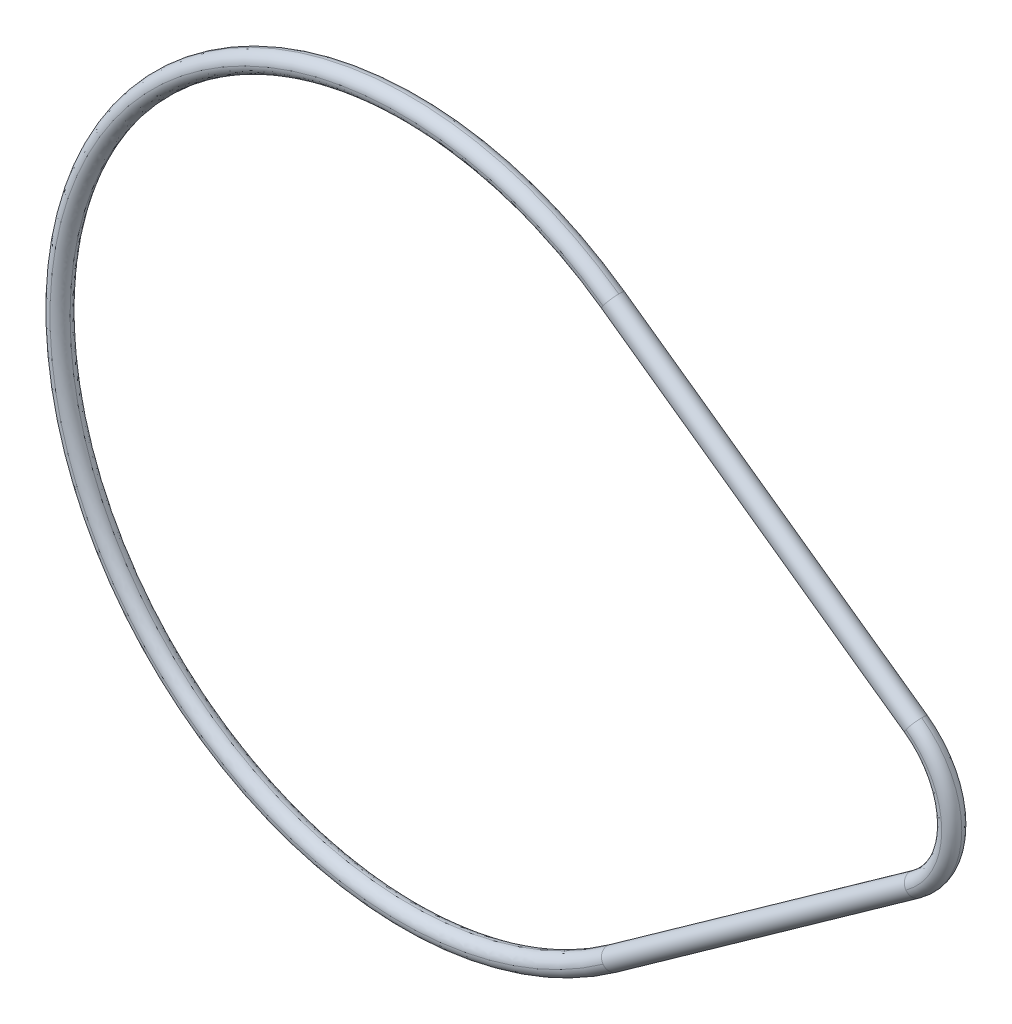
ISO-10303-21;
HEADER;
FILE_DESCRIPTION(('STEP AP214'),'2;1');
FILE_NAME('part.step','',(''),(''),'','','');
FILE_SCHEMA(('AUTOMOTIVE_DESIGN { 1 0 10303 214 1 1 1 1 }'));
ENDSEC;
DATA;
#1=APPLICATION_CONTEXT('core data for automotive mechanical design processes');
#2=APPLICATION_PROTOCOL_DEFINITION('international standard','automotive_design',2000,#1);
#3=PRODUCT_CONTEXT('',#1,'mechanical');
#4=PRODUCT('Part','Part','',(#3));
#5=PRODUCT_RELATED_PRODUCT_CATEGORY('part','',(#4));
#6=PRODUCT_DEFINITION_FORMATION('','',#4);
#7=PRODUCT_DEFINITION_CONTEXT('part definition',#1,'design');
#8=PRODUCT_DEFINITION('design','',#6,#7);
#9=PRODUCT_DEFINITION_SHAPE('','',#8);
#10=(LENGTH_UNIT() NAMED_UNIT(*) SI_UNIT(.MILLI.,.METRE.));
#11=(NAMED_UNIT(*) PLANE_ANGLE_UNIT() SI_UNIT($,.RADIAN.));
#12=(NAMED_UNIT(*) SI_UNIT($,.STERADIAN.) SOLID_ANGLE_UNIT());
#13=UNCERTAINTY_MEASURE_WITH_UNIT(LENGTH_MEASURE(1.E-05),#10,'distance_accuracy_value','');
#14=(GEOMETRIC_REPRESENTATION_CONTEXT(3) GLOBAL_UNCERTAINTY_ASSIGNED_CONTEXT((#13)) GLOBAL_UNIT_ASSIGNED_CONTEXT((#10,
#11,#12)) REPRESENTATION_CONTEXT('',''));
#15=CARTESIAN_POINT('',(0.,0.,0.));
#16=DIRECTION('',(0.,0.,1.));
#17=DIRECTION('',(1.,0.,0.));
#18=AXIS2_PLACEMENT_3D('',#15,#16,#17);
#19=CARTESIAN_POINT('',(36.0000000000003,-4.8919202022546E-13,4.96113750563188E-13));
#20=CARTESIAN_POINT('',(36.0000000000003,-4.89227889299751E-13,0.585786437627394));
#21=CARTESIAN_POINT('',(36.4142135623734,-4.89253252565417E-13,1.00000000000048));
#22=CARTESIAN_POINT('',(37.0000000000003,-4.89253252565417E-13,1.00000000000048));
#23=(BOUNDED_CURVE() B_SPLINE_CURVE(3,(#19,#20,#21,#22),.UNSPECIFIED.,.F.,
.F.) B_SPLINE_CURVE_WITH_KNOTS((4,4),(0.,1.),
.UNSPECIFIED.) CURVE() GEOMETRIC_REPRESENTATION_ITEM() RATIONAL_B_SPLINE_CURVE((1.,
0.804737854124367,0.804737854124367,1.)) REPRESENTATION_ITEM(''));
#24=CARTESIAN_POINT('',(45.5,0.,0.));
#25=DIRECTION('',(0.,0.,-1.));
#26=AXIS1_PLACEMENT('',#24,#25);
#27=SURFACE_OF_REVOLUTION('',#23,#26);
#28=CARTESIAN_POINT('',(45.5,0.,1.06397713344143E-13));
#29=DIRECTION('',(0.,0.,-1.));
#30=DIRECTION('',(-1.,0.,0.));
#31=AXIS2_PLACEMENT_3D('',#28,#29,#30);
#32=CIRCLE('',#31,9.50000000000036);
#33=CARTESIAN_POINT('',(51.0100000000734,7.73885650486097,0.));
#34=VERTEX_POINT('',#33);
#35=CARTESIAN_POINT('',(51.0100000000732,-7.73885650478063,1.50658482146819E-13));
#36=VERTEX_POINT('',#35);
#37=EDGE_CURVE('E233',#34,#36,#32,.T.);
#38=ORIENTED_EDGE('',*,*,#37,.F.);
#39=CARTESIAN_POINT('',(50.43,6.92424003050114,5.00519726622438E-13));
#40=DIRECTION('',(0.814616474176591,-0.580000000000085,0.));
#41=DIRECTION('',(0.580000000000085,0.814616474176591,0.));
#42=AXIS2_PLACEMENT_3D('',#39,#40,#41);
#43=CIRCLE('',#42,0.999999999999988);
#44=CARTESIAN_POINT('',(50.4300000001548,6.92424003063687,1.00000000019503));
#45=VERTEX_POINT('',#44);
#46=EDGE_CURVE('E114',#34,#45,#43,.T.);
#47=ORIENTED_EDGE('',*,*,#46,.T.);
#48=CARTESIAN_POINT('',(45.5,0.,0.999999999999901));
#49=DIRECTION('',(0.,0.,-1.));
#50=DIRECTION('',(-1.,0.,0.));
#51=AXIS2_PLACEMENT_3D('',#48,#49,#50);
#52=CIRCLE('',#51,8.49999999999931);
#53=CARTESIAN_POINT('',(50.4300000000531,-6.92424003057521,1.0000000002362));
#54=VERTEX_POINT('',#53);
#55=EDGE_CURVE('E126',#54,#45,#52,.F.);
#56=ORIENTED_EDGE('',*,*,#55,.F.);
#57=CARTESIAN_POINT('',(50.4299999999997,-6.92424003050138,4.88925908402195E-13));
#58=DIRECTION('',(0.814616474176693,0.579999999999942,0.));
#59=DIRECTION('',(-0.579999999999942,0.814616474176693,0.));
#60=AXIS2_PLACEMENT_3D('',#57,#58,#59);
#61=CIRCLE('',#60,0.999999999999995);
#62=EDGE_CURVE('E111',#54,#36,#61,.T.);
#63=ORIENTED_EDGE('',*,*,#62,.T.);
#64=EDGE_LOOP('',(#38,#47,#56,#63));
#65=FACE_BOUND('',#64,.T.);
#66=ADVANCED_FACE('F16',(#65),#27,.F.);
#67=CARTESIAN_POINT('',(20.2361999999164,28.4219687840595,0.));
#68=DIRECTION('',(-0.81461647417677,0.579999999999834,0.));
#69=DIRECTION('',(-0.579999999999834,-0.81461647417677,0.));
#70=AXIS2_PLACEMENT_3D('',#67,#68,#69);
#71=CYLINDRICAL_SURFACE('',#70,1.00000000005463);
#72=CARTESIAN_POINT('',(20.2361999999164,28.4219687840595,0.));
#73=DIRECTION('',(-0.814616474176769,0.579999999999835,0.));
#74=DIRECTION('',(-0.579999999999837,-0.814616474176768,0.));
#75=AXIS2_PLACEMENT_3D('',#72,#73,#74);
#76=CIRCLE('',#75,0.999999999856097);
#77=CARTESIAN_POINT('',(20.2362000001002,28.4219687841907,0.999999999892125));
#78=VERTEX_POINT('',#77);
#79=CARTESIAN_POINT('',(19.6562000000418,27.6073523099318,0.));
#80=VERTEX_POINT('',#79);
#81=EDGE_CURVE('E88',#78,#80,#76,.F.);
#82=ORIENTED_EDGE('',*,*,#81,.T.);
#83=CARTESIAN_POINT('',(20.2362000000836,28.4219687839405,0.));
#84=DIRECTION('',(0.814616474176769,-0.579999999999836,0.));
#85=DIRECTION('',(0.579999999999835,0.81461647417677,0.));
#86=AXIS2_PLACEMENT_3D('',#83,#84,#85);
#87=CIRCLE('',#86,0.999999999856095);
#88=CARTESIAN_POINT('',(20.2362000000802,28.421968784074,-0.999999999892046));
#89=VERTEX_POINT('',#88);
#90=EDGE_CURVE('E100',#80,#89,#87,.T.);
#91=ORIENTED_EDGE('',*,*,#90,.T.);
#92=CARTESIAN_POINT('',(20.2362000000006,28.4219687840235,2.08066327048359E-13));
#93=DIRECTION('',(-0.814616474176633,0.580000000000028,0.));
#94=DIRECTION('',(-0.580000000000028,-0.814616474176633,0.));
#95=AXIS2_PLACEMENT_3D('',#92,#93,#94);
#96=CIRCLE('',#95,1.);
#97=CARTESIAN_POINT('',(20.8161999999583,29.2365852580797,1.03112267838352E-13));
#98=VERTEX_POINT('',#97);
#99=EDGE_CURVE('E234',#98,#89,#96,.T.);
#100=ORIENTED_EDGE('',*,*,#99,.F.);
#101=CARTESIAN_POINT('',(20.2362000000836,28.4219687839405,0.));
#102=DIRECTION('',(0.814616474176769,-0.579999999999836,0.));
#103=DIRECTION('',(0.579999999999835,0.81461647417677,0.));
#104=AXIS2_PLACEMENT_3D('',#101,#102,#103);
#105=CIRCLE('',#104,0.999999999856095);
#106=EDGE_CURVE('E103',#98,#78,#105,.T.);
#107=ORIENTED_EDGE('',*,*,#106,.T.);
#108=EDGE_LOOP('',(#82,#91,#100,#107));
#109=FACE_BOUND('',#108,.T.);
#110=CARTESIAN_POINT('',(50.4299999998414,6.92424003060025,0.));
#111=DIRECTION('',(0.814616474176769,-0.579999999999836,0.));
#112=DIRECTION('',(0.579999999999836,0.814616474176769,0.));
#113=AXIS2_PLACEMENT_3D('',#110,#111,#112);
#114=CIRCLE('',#113,1.00000000027373);
#115=CARTESIAN_POINT('',(50.4300000000474,6.9242400306476,-1.00000000020013));
#116=VERTEX_POINT('',#115);
#117=CARTESIAN_POINT('',(49.8499999999207,6.10962355613123,0.));
#118=VERTEX_POINT('',#117);
#119=EDGE_CURVE('E105',#116,#118,#114,.F.);
#120=ORIENTED_EDGE('',*,*,#119,.T.);
#121=CARTESIAN_POINT('',(50.4300000001466,6.92424003038294,0.));
#122=DIRECTION('',(-0.814616474176769,0.579999999999835,0.));
#123=DIRECTION('',(-0.579999999999849,-0.81461647417676,0.));
#124=AXIS2_PLACEMENT_3D('',#121,#122,#123);
#125=CIRCLE('',#124,1.00000000025311);
#126=EDGE_CURVE('E20',#118,#45,#125,.T.);
#127=ORIENTED_EDGE('',*,*,#126,.T.);
#128=ORIENTED_EDGE('',*,*,#46,.F.);
#129=CARTESIAN_POINT('',(50.4300000000005,6.92424003050161,0.));
#130=DIRECTION('',(0.814616474176589,-0.580000000000089,0.));
#131=DIRECTION('',(0.580000000000089,0.814616474176589,0.));
#132=AXIS2_PLACEMENT_3D('',#129,#130,#131);
#133=CIRCLE('',#132,1.);
#134=EDGE_CURVE('E230',#116,#34,#133,.T.);
#135=ORIENTED_EDGE('',*,*,#134,.F.);
#136=EDGE_LOOP('',(#120,#127,#128,#135));
#137=FACE_BOUND('',#136,.T.);
#138=ADVANCED_FACE('F97',(#109,#137),#71,.T.);
#139=CARTESIAN_POINT('',(37.0000000000007,-4.89253252565417E-13,0.999999999999901));
#140=CARTESIAN_POINT('',(37.5857864376276,-4.89253252565417E-13,0.999999999999876));
#141=CARTESIAN_POINT('',(38.0000000000007,-4.89227889299751E-13,0.585786437626763));
#142=CARTESIAN_POINT('',(38.0000000000006,-4.8919202022546E-13,-1.42047314812063E-13));
#143=(BOUNDED_CURVE() B_SPLINE_CURVE(3,(#139,#140,#141,#142),.UNSPECIFIED.,.F.,
.F.) B_SPLINE_CURVE_WITH_KNOTS((4,4),(0.,1.),
.UNSPECIFIED.) CURVE() GEOMETRIC_REPRESENTATION_ITEM() RATIONAL_B_SPLINE_CURVE((1.,
0.804737854124365,0.804737854124365,1.)) REPRESENTATION_ITEM(''));
#144=CARTESIAN_POINT('',(45.5,0.,0.));
#145=DIRECTION('',(0.,0.,-1.));
#146=AXIS1_PLACEMENT('',#144,#145);
#147=SURFACE_OF_REVOLUTION('',#143,#146);
#148=ORIENTED_EDGE('',*,*,#55,.T.);
#149=ORIENTED_EDGE('',*,*,#126,.F.);
#150=CARTESIAN_POINT('',(45.5,0.,0.));
#151=DIRECTION('',(0.,0.,-1.));
#152=DIRECTION('',(-1.,0.,0.));
#153=AXIS2_PLACEMENT_3D('',#150,#151,#152);
#154=CIRCLE('',#153,7.5);
#155=CARTESIAN_POINT('',(49.8499999999601,-6.10962355626853,0.));
#156=VERTEX_POINT('',#155);
#157=EDGE_CURVE('E228',#156,#118,#154,.F.);
#158=ORIENTED_EDGE('',*,*,#157,.F.);
#159=CARTESIAN_POINT('',(50.4299999999994,-6.92424003050115,0.));
#160=DIRECTION('',(0.814616474176693,0.579999999999943,0.));
#161=DIRECTION('',(-0.579999999999943,0.814616474176693,0.));
#162=AXIS2_PLACEMENT_3D('',#159,#160,#161);
#163=CIRCLE('',#162,0.999999999999998);
#164=EDGE_CURVE('E116',#156,#54,#163,.T.);
#165=ORIENTED_EDGE('',*,*,#164,.T.);
#166=EDGE_LOOP('',(#148,#149,#158,#165));
#167=FACE_BOUND('',#166,.T.);
#168=ADVANCED_FACE('F138',(#167),#147,.F.);
#169=CARTESIAN_POINT('',(36.9999999999996,-4.89130787885502E-13,-0.999999999999901));
#170=CARTESIAN_POINT('',(36.4142135623727,-4.89130787885502E-13,-0.999999999999897));
#171=CARTESIAN_POINT('',(35.9999999999996,-4.89156151151168E-13,-0.585786437626799));
#172=CARTESIAN_POINT('',(35.9999999999996,-4.89192020225459E-13,1.06397713344143E-13));
#173=(BOUNDED_CURVE() B_SPLINE_CURVE(3,(#169,#170,#171,#172),.UNSPECIFIED.,.F.,
.F.) B_SPLINE_CURVE_WITH_KNOTS((4,4),(0.,1.),
.UNSPECIFIED.) CURVE() GEOMETRIC_REPRESENTATION_ITEM() RATIONAL_B_SPLINE_CURVE((1.,
0.804737854124365,0.804737854124365,1.)) REPRESENTATION_ITEM(''));
#174=CARTESIAN_POINT('',(45.5,0.,0.));
#175=DIRECTION('',(0.,0.,-1.));
#176=AXIS1_PLACEMENT('',#174,#175);
#177=SURFACE_OF_REVOLUTION('',#173,#176);
#178=ORIENTED_EDGE('',*,*,#134,.T.);
#179=ORIENTED_EDGE('',*,*,#37,.T.);
#180=CARTESIAN_POINT('',(50.4300000000001,-6.92424003050188,1.00490373496332E-13));
#181=DIRECTION('',(0.814616474176691,0.579999999999945,0.));
#182=DIRECTION('',(-0.579999999999945,0.814616474176691,0.));
#183=AXIS2_PLACEMENT_3D('',#180,#181,#182);
#184=CIRCLE('',#183,1.);
#185=CARTESIAN_POINT('',(50.4300000001171,-6.92424003066574,-1.0000000000658));
#186=VERTEX_POINT('',#185);
#187=EDGE_CURVE('E128',#36,#186,#184,.T.);
#188=ORIENTED_EDGE('',*,*,#187,.T.);
#189=CARTESIAN_POINT('',(45.5,0.,-1.));
#190=DIRECTION('',(0.,0.,-1.));
#191=DIRECTION('',(-1.,0.,0.));
#192=AXIS2_PLACEMENT_3D('',#189,#190,#191);
#193=CIRCLE('',#192,8.50000000040606);
#194=EDGE_CURVE('E207',#116,#186,#193,.T.);
#195=ORIENTED_EDGE('',*,*,#194,.F.);
#196=EDGE_LOOP('',(#178,#179,#188,#195));
#197=FACE_BOUND('',#196,.T.);
#198=ADVANCED_FACE('F141',(#197),#177,.F.);
#199=CARTESIAN_POINT('',(38.,0.,0.));
#200=CARTESIAN_POINT('',(38.,0.,-0.585786437626905));
#201=CARTESIAN_POINT('',(37.5857864376269,0.,-1.));
#202=CARTESIAN_POINT('',(37.,0.,-1.));
#203=(BOUNDED_CURVE() B_SPLINE_CURVE(3,(#199,#200,#201,#202),.UNSPECIFIED.,.F.,
.F.) B_SPLINE_CURVE_WITH_KNOTS((4,4),(0.,1.),
.UNSPECIFIED.) CURVE() GEOMETRIC_REPRESENTATION_ITEM() RATIONAL_B_SPLINE_CURVE((1.,
0.804737854124365,0.804737854124365,1.)) REPRESENTATION_ITEM(''));
#204=CARTESIAN_POINT('',(45.5,0.,0.));
#205=DIRECTION('',(0.,0.,-1.));
#206=AXIS1_PLACEMENT('',#204,#205);
#207=SURFACE_OF_REVOLUTION('',#203,#206);
#208=ORIENTED_EDGE('',*,*,#119,.F.);
#209=ORIENTED_EDGE('',*,*,#194,.T.);
#210=CARTESIAN_POINT('',(50.4299999998414,-6.92424003060026,0.));
#211=DIRECTION('',(-0.814616474176769,-0.579999999999835,0.));
#212=DIRECTION('',(0.579999999999828,-0.814616474176774,0.));
#213=AXIS2_PLACEMENT_3D('',#210,#211,#212);
#214=CIRCLE('',#213,1.00000000027371);
#215=EDGE_CURVE('E201',#156,#186,#214,.T.);
#216=ORIENTED_EDGE('',*,*,#215,.F.);
#217=ORIENTED_EDGE('',*,*,#157,.T.);
#218=EDGE_LOOP('',(#208,#209,#216,#217));
#219=FACE_BOUND('',#218,.T.);
#220=ADVANCED_FACE('F216',(#219),#207,.F.);
#221=CARTESIAN_POINT('',(50.4300000003895,-6.92424003072267,0.));
#222=DIRECTION('',(0.814616474176298,0.580000000000497,0.));
#223=DIRECTION('',(-0.580000000000497,0.814616474176298,0.));
#224=AXIS2_PLACEMENT_3D('',#221,#222,#223);
#225=CYLINDRICAL_SURFACE('',#224,1.00000000048727);
#226=CARTESIAN_POINT('',(20.2361999999164,-28.4219687840595,0.));
#227=DIRECTION('',(0.814616474176769,0.579999999999836,0.));
#228=DIRECTION('',(-0.579999999999837,0.814616474176768,0.));
#229=AXIS2_PLACEMENT_3D('',#226,#227,#228);
#230=CIRCLE('',#229,0.999999999856097);
#231=CARTESIAN_POINT('',(20.8161999999582,-29.2365852581299,2.07970276346129E-13));
#232=VERTEX_POINT('',#231);
#233=CARTESIAN_POINT('',(20.2362000000606,-28.4219687840969,-0.999999999927998));
#234=VERTEX_POINT('',#233);
#235=EDGE_CURVE('E205',#232,#234,#230,.T.);
#236=ORIENTED_EDGE('',*,*,#235,.T.);
#237=CARTESIAN_POINT('',(20.2362000000836,-28.4219687839405,0.));
#238=DIRECTION('',(-0.814616474176769,-0.579999999999835,0.));
#239=DIRECTION('',(0.579999999999835,-0.81461647417677,0.));
#240=AXIS2_PLACEMENT_3D('',#237,#238,#239);
#241=CIRCLE('',#240,0.999999999856095);
#242=CARTESIAN_POINT('',(19.6562000000835,-27.6073523099021,0.));
#243=VERTEX_POINT('',#242);
#244=EDGE_CURVE('E35',#234,#243,#241,.F.);
#245=ORIENTED_EDGE('',*,*,#244,.T.);
#246=CARTESIAN_POINT('',(20.2361999999994,-28.4219687840229,-1.97653087520178E-13));
#247=DIRECTION('',(-0.814616474176668,-0.579999999999978,0.));
#248=DIRECTION('',(0.579999999999978,-0.814616474176668,0.));
#249=AXIS2_PLACEMENT_3D('',#246,#247,#248);
#250=CIRCLE('',#249,0.999999999999996);
#251=CARTESIAN_POINT('',(20.2362000001421,-28.4219687841609,1.00000000000408));
#252=VERTEX_POINT('',#251);
#253=EDGE_CURVE('E90',#252,#243,#250,.T.);
#254=ORIENTED_EDGE('',*,*,#253,.F.);
#255=CARTESIAN_POINT('',(20.2362000000836,-28.4219687839405,0.));
#256=DIRECTION('',(-0.814616474176769,-0.579999999999835,0.));
#257=DIRECTION('',(0.579999999999835,-0.81461647417677,0.));
#258=AXIS2_PLACEMENT_3D('',#255,#256,#257);
#259=CIRCLE('',#258,0.999999999856095);
#260=EDGE_CURVE('E198',#252,#232,#259,.F.);
#261=ORIENTED_EDGE('',*,*,#260,.T.);
#262=EDGE_LOOP('',(#236,#245,#254,#261));
#263=FACE_BOUND('',#262,.T.);
#264=ORIENTED_EDGE('',*,*,#215,.T.);
#265=ORIENTED_EDGE('',*,*,#187,.F.);
#266=ORIENTED_EDGE('',*,*,#62,.F.);
#267=ORIENTED_EDGE('',*,*,#164,.F.);
#268=EDGE_LOOP('',(#264,#265,#266,#267));
#269=FACE_BOUND('',#268,.T.);
#270=ADVANCED_FACE('F189',(#263,#269),#225,.T.);
#271=CARTESIAN_POINT('',(-34.8899999999992,-6.33235301071492E-13,0.999999999999801));
#272=CARTESIAN_POINT('',(-34.3042135623723,-6.33235301071491E-13,0.999999999999809));
#273=CARTESIAN_POINT('',(-33.8899999999992,-6.33209937805825E-13,0.58578643762672));
#274=CARTESIAN_POINT('',(-33.8899999999992,-6.33174068731534E-13,-1.84679878957669E-13));
#275=(BOUNDED_CURVE() B_SPLINE_CURVE(3,(#271,#272,#273,#274),.UNSPECIFIED.,.F.,
.F.) B_SPLINE_CURVE_WITH_KNOTS((4,4),(0.,1.),
.UNSPECIFIED.) CURVE() GEOMETRIC_REPRESENTATION_ITEM() RATIONAL_B_SPLINE_CURVE((1.,
0.804737854124365,0.804737854124365,1.)) REPRESENTATION_ITEM(''));
#276=CARTESIAN_POINT('',(0.,0.,0.));
#277=DIRECTION('',(0.,0.,-1.));
#278=AXIS1_PLACEMENT('',#276,#277);
#279=SURFACE_OF_REVOLUTION('',#275,#278);
#280=CARTESIAN_POINT('',(0.,0.,1.00000000000063));
#281=DIRECTION('',(0.,0.,-1.));
#282=DIRECTION('',(-1.,0.,0.));
#283=AXIS2_PLACEMENT_3D('',#280,#281,#282);
#284=CIRCLE('',#283,34.8899999999997);
#285=EDGE_CURVE('E93',#252,#78,#284,.T.);
#286=ORIENTED_EDGE('',*,*,#285,.F.);
#287=ORIENTED_EDGE('',*,*,#253,.T.);
#288=CARTESIAN_POINT('',(0.,0.,0.));
#289=DIRECTION('',(0.,0.,-1.));
#290=DIRECTION('',(-1.,0.,0.));
#291=AXIS2_PLACEMENT_3D('',#288,#289,#290);
#292=CIRCLE('',#291,33.89);
#293=EDGE_CURVE('E84',#80,#243,#292,.F.);
#294=ORIENTED_EDGE('',*,*,#293,.F.);
#295=ORIENTED_EDGE('',*,*,#81,.F.);
#296=EDGE_LOOP('',(#286,#287,#294,#295));
#297=FACE_BOUND('',#296,.T.);
#298=ADVANCED_FACE('F87',(#297),#279,.F.);
#299=CARTESIAN_POINT('',(-35.8899999999997,-6.33174068731535E-13,6.32990371711663E-13));
#300=CARTESIAN_POINT('',(-35.8899999999997,-6.33209937805826E-13,0.585786437627534));
#301=CARTESIAN_POINT('',(-35.4757864376266,-6.33235301071492E-13,1.00000000000063));
#302=CARTESIAN_POINT('',(-34.8899999999997,-6.33235301071492E-13,1.00000000000063));
#303=(BOUNDED_CURVE() B_SPLINE_CURVE(3,(#299,#300,#301,#302),.UNSPECIFIED.,.F.,
.F.) B_SPLINE_CURVE_WITH_KNOTS((4,4),(0.,1.),
.UNSPECIFIED.) CURVE() GEOMETRIC_REPRESENTATION_ITEM() RATIONAL_B_SPLINE_CURVE((1.,
0.804737854124365,0.804737854124365,1.)) REPRESENTATION_ITEM(''));
#304=CARTESIAN_POINT('',(0.,0.,0.));
#305=DIRECTION('',(0.,0.,-1.));
#306=AXIS1_PLACEMENT('',#304,#305);
#307=SURFACE_OF_REVOLUTION('',#303,#306);
#308=CARTESIAN_POINT('',(0.,0.,1.98768268992956E-13));
#309=DIRECTION('',(0.,0.,-1.));
#310=DIRECTION('',(-1.,0.,0.));
#311=AXIS2_PLACEMENT_3D('',#308,#309,#310);
#312=CIRCLE('',#311,35.8900000000005);
#313=EDGE_CURVE('E26',#232,#98,#312,.T.);
#314=ORIENTED_EDGE('',*,*,#313,.F.);
#315=ORIENTED_EDGE('',*,*,#260,.F.);
#316=ORIENTED_EDGE('',*,*,#285,.T.);
#317=ORIENTED_EDGE('',*,*,#106,.F.);
#318=EDGE_LOOP('',(#314,#315,#316,#317));
#319=FACE_BOUND('',#318,.T.);
#320=ADVANCED_FACE('F157',(#319),#307,.F.);
#321=CARTESIAN_POINT('',(-33.89,0.,0.));
#322=CARTESIAN_POINT('',(-33.89,0.,-0.585786437626905));
#323=CARTESIAN_POINT('',(-34.3042135623731,0.,-1.));
#324=CARTESIAN_POINT('',(-34.89,0.,-1.));
#325=(BOUNDED_CURVE() B_SPLINE_CURVE(3,(#321,#322,#323,#324),.UNSPECIFIED.,.F.,
.F.) B_SPLINE_CURVE_WITH_KNOTS((4,4),(0.,1.),
.UNSPECIFIED.) CURVE() GEOMETRIC_REPRESENTATION_ITEM() RATIONAL_B_SPLINE_CURVE((1.,
0.804737854124365,0.804737854124365,1.)) REPRESENTATION_ITEM(''));
#326=CARTESIAN_POINT('',(0.,0.,0.));
#327=DIRECTION('',(0.,0.,-1.));
#328=AXIS1_PLACEMENT('',#326,#327);
#329=SURFACE_OF_REVOLUTION('',#325,#328);
#330=ORIENTED_EDGE('',*,*,#293,.T.);
#331=ORIENTED_EDGE('',*,*,#244,.F.);
#332=CARTESIAN_POINT('',(0.,0.,-0.999999999999801));
#333=DIRECTION('',(0.,0.,-1.));
#334=DIRECTION('',(-1.,0.,0.));
#335=AXIS2_PLACEMENT_3D('',#332,#333,#334);
#336=CIRCLE('',#335,34.8900000000005);
#337=EDGE_CURVE('E11',#89,#234,#336,.F.);
#338=ORIENTED_EDGE('',*,*,#337,.F.);
#339=ORIENTED_EDGE('',*,*,#90,.F.);
#340=EDGE_LOOP('',(#330,#331,#338,#339));
#341=FACE_BOUND('',#340,.T.);
#342=ADVANCED_FACE('F104',(#341),#329,.F.);
#343=CARTESIAN_POINT('',(-34.8900000000005,-6.33112836391577E-13,-0.999999999999801));
#344=CARTESIAN_POINT('',(-35.4757864376274,-6.33112836391577E-13,-0.999999999999801));
#345=CARTESIAN_POINT('',(-35.8900000000005,-6.33138199657243E-13,-0.585786437626706));
#346=CARTESIAN_POINT('',(-35.8900000000005,-6.33174068731535E-13,1.98768268992956E-13));
#347=(BOUNDED_CURVE() B_SPLINE_CURVE(3,(#343,#344,#345,#346),.UNSPECIFIED.,.F.,
.F.) B_SPLINE_CURVE_WITH_KNOTS((4,4),(0.,1.),
.UNSPECIFIED.) CURVE() GEOMETRIC_REPRESENTATION_ITEM() RATIONAL_B_SPLINE_CURVE((1.,
0.804737854124365,0.804737854124365,1.)) REPRESENTATION_ITEM(''));
#348=CARTESIAN_POINT('',(0.,0.,0.));
#349=DIRECTION('',(0.,0.,-1.));
#350=AXIS1_PLACEMENT('',#348,#349);
#351=SURFACE_OF_REVOLUTION('',#347,#350);
#352=ORIENTED_EDGE('',*,*,#337,.T.);
#353=ORIENTED_EDGE('',*,*,#235,.F.);
#354=ORIENTED_EDGE('',*,*,#313,.T.);
#355=ORIENTED_EDGE('',*,*,#99,.T.);
#356=EDGE_LOOP('',(#352,#353,#354,#355));
#357=FACE_BOUND('',#356,.T.);
#358=ADVANCED_FACE('F150',(#357),#351,.F.);
#359=CLOSED_SHELL('',(#66,#138,#168,#198,#220,#270,#298,#320,#342,#358));
#360=MANIFOLD_SOLID_BREP('B1',#359);
#361=ADVANCED_BREP_SHAPE_REPRESENTATION('',(#18,#360),#14);
#362=SHAPE_DEFINITION_REPRESENTATION(#9,#361);
ENDSEC;
END-ISO-10303-21;
